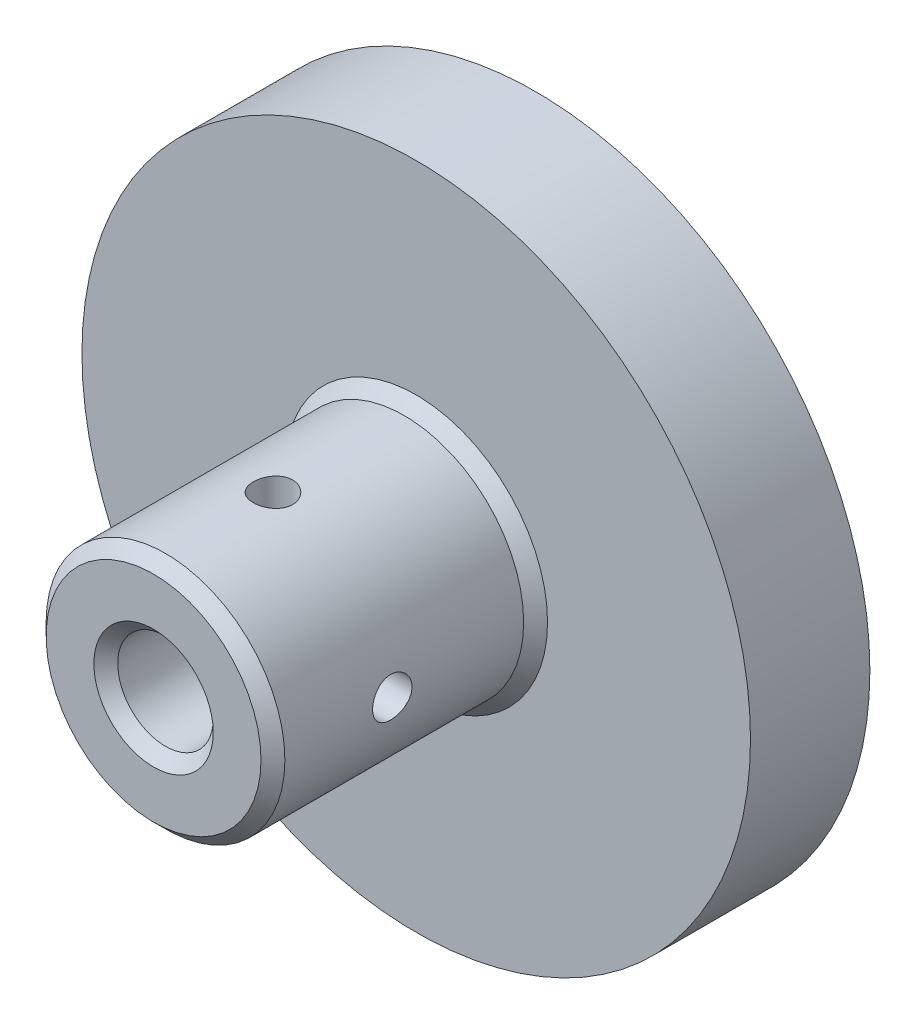
ISO-10303-21;
HEADER;
FILE_DESCRIPTION(('STEP AP214'),'2;1');
FILE_NAME('part.step','',(''),(''),'','','');
FILE_SCHEMA(('AUTOMOTIVE_DESIGN { 1 0 10303 214 1 1 1 1 }'));
ENDSEC;
DATA;
#1=APPLICATION_CONTEXT('core data for automotive mechanical design processes');
#2=APPLICATION_PROTOCOL_DEFINITION('international standard','automotive_design',2000,#1);
#3=PRODUCT_CONTEXT('',#1,'mechanical');
#4=PRODUCT('Part','Part','',(#3));
#5=PRODUCT_RELATED_PRODUCT_CATEGORY('part','',(#4));
#6=PRODUCT_DEFINITION_FORMATION('','',#4);
#7=PRODUCT_DEFINITION_CONTEXT('part definition',#1,'design');
#8=PRODUCT_DEFINITION('design','',#6,#7);
#9=PRODUCT_DEFINITION_SHAPE('','',#8);
#10=(LENGTH_UNIT() NAMED_UNIT(*) SI_UNIT(.MILLI.,.METRE.));
#11=(NAMED_UNIT(*) PLANE_ANGLE_UNIT() SI_UNIT($,.RADIAN.));
#12=(NAMED_UNIT(*) SI_UNIT($,.STERADIAN.) SOLID_ANGLE_UNIT());
#13=UNCERTAINTY_MEASURE_WITH_UNIT(LENGTH_MEASURE(1.E-05),#10,'distance_accuracy_value','');
#14=(GEOMETRIC_REPRESENTATION_CONTEXT(3) GLOBAL_UNCERTAINTY_ASSIGNED_CONTEXT((#13)) GLOBAL_UNIT_ASSIGNED_CONTEXT((#10,
#11,#12)) REPRESENTATION_CONTEXT('',''));
#15=CARTESIAN_POINT('',(0.,0.,0.));
#16=DIRECTION('',(0.,0.,1.));
#17=DIRECTION('',(1.,0.,0.));
#18=AXIS2_PLACEMENT_3D('',#15,#16,#17);
#19=CARTESIAN_POINT('',(0.,0.,10.));
#20=DIRECTION('',(0.,0.,-1.));
#21=DIRECTION('',(-1.,0.,0.));
#22=AXIS2_PLACEMENT_3D('',#19,#20,#21);
#23=CYLINDRICAL_SURFACE('',#22,28.);
#24=CARTESIAN_POINT('',(0.,0.,10.));
#25=DIRECTION('',(0.,0.,1.));
#26=DIRECTION('',(1.,0.,0.));
#27=AXIS2_PLACEMENT_3D('',#24,#25,#26);
#28=CIRCLE('',#27,28.);
#29=CARTESIAN_POINT('',(28.,0.,10.));
#30=VERTEX_POINT('',#29);
#31=EDGE_CURVE('E64',#30,#30,#28,.T.);
#32=ORIENTED_EDGE('',*,*,#31,.F.);
#33=EDGE_LOOP('',(#32));
#34=FACE_BOUND('',#33,.T.);
#35=CARTESIAN_POINT('',(0.,0.,0.));
#36=DIRECTION('',(0.,0.,1.));
#37=DIRECTION('',(1.,0.,0.));
#38=AXIS2_PLACEMENT_3D('',#35,#36,#37);
#39=CIRCLE('',#38,28.);
#40=CARTESIAN_POINT('',(28.,0.,0.));
#41=VERTEX_POINT('',#40);
#42=EDGE_CURVE('E65',#41,#41,#39,.T.);
#43=ORIENTED_EDGE('',*,*,#42,.T.);
#44=EDGE_LOOP('',(#43));
#45=FACE_BOUND('',#44,.T.);
#46=ADVANCED_FACE('F38',(#34,#45),#23,.T.);
#47=CARTESIAN_POINT('',(0.,0.,10.));
#48=DIRECTION('',(0.,0.,1.));
#49=DIRECTION('',(1.,0.,0.));
#50=AXIS2_PLACEMENT_3D('',#47,#48,#49);
#51=PLANE('',#50);
#52=CARTESIAN_POINT('',(0.,0.,10.));
#53=DIRECTION('',(0.,0.,1.));
#54=DIRECTION('',(1.,0.,0.));
#55=AXIS2_PLACEMENT_3D('',#52,#53,#54);
#56=CIRCLE('',#55,11.);
#57=CARTESIAN_POINT('',(11.,0.,10.));
#58=VERTEX_POINT('',#57);
#59=EDGE_CURVE('E11',#58,#58,#56,.F.);
#60=ORIENTED_EDGE('',*,*,#59,.T.);
#61=EDGE_LOOP('',(#60));
#62=FACE_BOUND('',#61,.T.);
#63=ORIENTED_EDGE('',*,*,#31,.T.);
#64=EDGE_LOOP('',(#63));
#65=FACE_BOUND('',#64,.T.);
#66=ADVANCED_FACE('F116',(#62,#65),#51,.T.);
#67=CARTESIAN_POINT('',(0.,0.,0.));
#68=DIRECTION('',(0.,0.,1.));
#69=DIRECTION('',(1.,0.,0.));
#70=AXIS2_PLACEMENT_3D('',#67,#68,#69);
#71=PLANE('',#70);
#72=CARTESIAN_POINT('',(0.,0.,0.));
#73=DIRECTION('',(0.,0.,1.));
#74=DIRECTION('',(1.,0.,0.));
#75=AXIS2_PLACEMENT_3D('',#72,#73,#74);
#76=CIRCLE('',#75,4.);
#77=CARTESIAN_POINT('',(4.,0.,0.));
#78=VERTEX_POINT('',#77);
#79=EDGE_CURVE('E68',#78,#78,#76,.T.);
#80=ORIENTED_EDGE('',*,*,#79,.T.);
#81=EDGE_LOOP('',(#80));
#82=FACE_BOUND('',#81,.T.);
#83=ORIENTED_EDGE('',*,*,#42,.F.);
#84=EDGE_LOOP('',(#83));
#85=FACE_BOUND('',#84,.T.);
#86=ADVANCED_FACE('F112',(#82,#85),#71,.F.);
#87=CARTESIAN_POINT('',(0.,0.,32.));
#88=DIRECTION('',(0.,0.,-1.));
#89=DIRECTION('',(-1.,0.,0.));
#90=AXIS2_PLACEMENT_3D('',#87,#88,#89);
#91=CYLINDRICAL_SURFACE('',#90,10.);
#92=CARTESIAN_POINT('',(10.,0.,20.35));
#93=CARTESIAN_POINT('',(9.99999843258099,-0.0920114531057513,20.3500037009853));
#94=CARTESIAN_POINT('',(9.99871684765511,-0.184073454347173,20.3577224586854));
#95=CARTESIAN_POINT('',(9.99372775496381,-0.36561632253533,20.3883812351379));
#96=CARTESIAN_POINT('',(9.99001800272159,-0.455094721351769,20.4113353369588));
#97=CARTESIAN_POINT('',(9.98058875631552,-0.628817487751617,20.4717536389359));
#98=CARTESIAN_POINT('',(9.974870893487,-0.713066038744489,20.5092060635603));
#99=CARTESIAN_POINT('',(9.96205444853338,-0.874072236504047,20.5975272541486));
#100=CARTESIAN_POINT('',(9.95495602786423,-0.950830757653335,20.648394451505));
#101=CARTESIAN_POINT('',(9.9400912001718,-1.09540879372213,20.7626087771329));
#102=CARTESIAN_POINT('',(9.93231968689365,-1.1631478788234,20.8260570636182));
#103=CARTESIAN_POINT('',(9.91702374723339,-1.28706950777736,20.9634147735932));
#104=CARTESIAN_POINT('',(9.90949933632427,-1.3432513290959,21.0373248506432));
#105=CARTESIAN_POINT('',(9.89550007731641,-1.44278500045255,21.1940593436766));
#106=CARTESIAN_POINT('',(9.88903182722124,-1.486057495709,21.2769347943439));
#107=CARTESIAN_POINT('',(9.87794796970923,-1.55803674048926,21.4489026252365));
#108=CARTESIAN_POINT('',(9.87333223970889,-1.58674445381558,21.5379945936492));
#109=CARTESIAN_POINT('',(9.86652679242373,-1.62852619503012,21.719014582001));
#110=CARTESIAN_POINT('',(9.86431555933323,-1.64173895927954,21.8109097556787));
#111=CARTESIAN_POINT('',(9.86250435770822,-1.6525858553069,21.9956373659234));
#112=CARTESIAN_POINT('',(9.86290420804218,-1.65022106770363,22.0884697370306));
#113=CARTESIAN_POINT('',(9.86625034802631,-1.63009303176281,22.2714472770567));
#114=CARTESIAN_POINT('',(9.86917088684506,-1.61248549472491,22.3616101140273));
#115=CARTESIAN_POINT('',(9.87718903199042,-1.56261607367814,22.5376840705334));
#116=CARTESIAN_POINT('',(9.88228671162732,-1.53035369619842,22.6235950467882));
#117=CARTESIAN_POINT('',(9.89411264039673,-1.45193210975576,22.7891935299244));
#118=CARTESIAN_POINT('',(9.90084846298693,-1.40570810605855,22.8688497892407));
#119=CARTESIAN_POINT('',(9.91518643931069,-1.30072141548382,23.0193343239077));
#120=CARTESIAN_POINT('',(9.92278866158315,-1.24195773629992,23.0901618999123));
#121=CARTESIAN_POINT('',(9.93811607123993,-1.11271072676608,23.2218799788826));
#122=CARTESIAN_POINT('',(9.94584163094155,-1.04209376928229,23.2826393946299));
#123=CARTESIAN_POINT('',(9.96045987838133,-0.891597059898627,23.3914660216062));
#124=CARTESIAN_POINT('',(9.9673525609492,-0.81171725050342,23.4395331540471));
#125=CARTESIAN_POINT('',(9.97953794169528,-0.644840083170818,23.5216221505343));
#126=CARTESIAN_POINT('',(9.98482933722618,-0.557837003156625,23.555632587638));
#127=CARTESIAN_POINT('',(9.99320544362233,-0.379246930002538,23.6085219127753));
#128=CARTESIAN_POINT('',(9.99629033536768,-0.28766031326089,23.6274020411448));
#129=CARTESIAN_POINT('',(9.99988156603306,-0.10363298381923,23.6493174611612));
#130=CARTESIAN_POINT('',(10.0004171933872,-0.0112142564119049,23.6525327361215));
#131=CARTESIAN_POINT('',(9.99892971175882,0.172841505554612,23.6435068013197));
#132=CARTESIAN_POINT('',(9.99690669920295,0.264478569441094,23.6312661740395));
#133=CARTESIAN_POINT('',(9.99054737820398,0.443814955541701,23.5918255972229));
#134=CARTESIAN_POINT('',(9.98622483070292,0.531534371938234,23.5647146056917));
#135=CARTESIAN_POINT('',(9.97574921956607,0.701182959294526,23.4963976074449));
#136=CARTESIAN_POINT('',(9.96959605484328,0.783111810188923,23.4551908223383));
#137=CARTESIAN_POINT('',(9.95606928426947,0.939636398877187,23.359438680501));
#138=CARTESIAN_POINT('',(9.94868555427359,1.01416235726441,23.3047807140829));
#139=CARTESIAN_POINT('',(9.93354765732488,1.15304841333202,23.1838328509312));
#140=CARTESIAN_POINT('',(9.92579346406183,1.2174077875821,23.1175421271457));
#141=CARTESIAN_POINT('',(9.91069407401677,1.33479962911466,22.9744038936717));
#142=CARTESIAN_POINT('',(9.90335382329476,1.38771058951938,22.8974561289012));
#143=CARTESIAN_POINT('',(9.89000528724129,1.47985547415611,22.7356589529326));
#144=CARTESIAN_POINT('',(9.88399696030452,1.51908982562642,22.6508097886681));
#145=CARTESIAN_POINT('',(9.87402953570154,1.58258535747081,22.4759604675969));
#146=CARTESIAN_POINT('',(9.87006212213644,1.60690737863644,22.3859829002034));
#147=CARTESIAN_POINT('',(9.86460473721113,1.64007952798871,22.2031486882195));
#148=CARTESIAN_POINT('',(9.86311455516769,1.64893097191814,22.1102922891519));
#149=CARTESIAN_POINT('',(9.86278931217107,1.65087457438791,21.9255493586982));
#150=CARTESIAN_POINT('',(9.86392203182987,1.6441579678695,21.8336648398079));
#151=CARTESIAN_POINT('',(9.86864441177183,1.61556925478543,21.6523522481362));
#152=CARTESIAN_POINT('',(9.87223406454433,1.59369719454883,21.5629241678464));
#153=CARTESIAN_POINT('',(9.88145370519206,1.53549112071354,21.3891347575646));
#154=CARTESIAN_POINT('',(9.8870814149876,1.49917324977363,21.3047678925491));
#155=CARTESIAN_POINT('',(9.89974533231771,1.41312606218932,21.1432937331397));
#156=CARTESIAN_POINT('',(9.90678160742253,1.36339610211419,21.0661867872723));
#157=CARTESIAN_POINT('',(9.92157214136343,1.25125259966704,20.9204545023623));
#158=CARTESIAN_POINT('',(9.92933379899766,1.18869826623125,20.8519382401805));
#159=CARTESIAN_POINT('',(9.94464125601211,1.05297867490408,20.7263094001233));
#160=CARTESIAN_POINT('',(9.95218700513286,0.97981097009266,20.6691994592198));
#161=CARTESIAN_POINT('',(9.96627143049841,0.824354696103038,20.5676525774265));
#162=CARTESIAN_POINT('',(9.97280295936929,0.742007852048179,20.523303852022));
#163=CARTESIAN_POINT('',(9.98405342047581,0.57095958692379,20.4491366471937));
#164=CARTESIAN_POINT('',(9.98877416450827,0.482264623543759,20.4193036358748));
#165=CARTESIAN_POINT('',(9.99483601455804,0.327682758240926,20.3815206584732));
#166=CARTESIAN_POINT('',(9.99676220083327,0.262733066711098,20.3697192511855));
#167=CARTESIAN_POINT('',(9.99934474465587,0.13186422762594,20.3539576610669));
#168=CARTESIAN_POINT('',(10.0000011233775,0.0659450962546684,20.3499973474842));
#169=CARTESIAN_POINT('',(10.,0.,20.35));
#170=B_SPLINE_CURVE_WITH_KNOTS('',3,(#92,#93,#94,#95,#96,#97,#98,#99,#100,#101,#102,#103,#104,
#105,#106,#107,#108,#109,#110,#111,#112,#113,#114,#115,#116,#117,#118,#119,#120,#121,#122,#123,
#124,#125,#126,#127,#128,#129,#130,#131,#132,#133,#134,#135,#136,#137,#138,#139,#140,#141,#142,
#143,#144,#145,#146,#147,#148,#149,#150,#151,#152,#153,#154,#155,#156,#157,#158,#159,#160,#161,
#162,#163,#164,#165,#166,#167,#168,#169),.UNSPECIFIED.,.T.,.F.,(4,2,2,2,2,2,2,2,2,2,2,2,2,2,2,2,
2,2,2,2,2,2,2,2,2,2,2,2,2,2,2,2,2,2,2,2,2,2,4),(0.,0.275793319008918,0.551841928312972,
0.8276667998706,1.10345943314171,1.38156673144316,1.65969141110741,1.93949209608633,
2.21927426326044,2.49653175525206,2.77377001402269,3.04820914252877,3.32265751287872,
3.59839967320042,3.87416366201706,4.1532757240192,4.43238951858747,4.71172976565332,
4.991047110928,5.26714751096616,5.54323750600189,5.81769359979004,6.09216485190803,
6.36901711215385,6.64588906369257,6.92556925596458,7.20524071063227,7.48376340648032,
7.76226241335696,8.03735855216245,8.31245385002402,8.58724259883659,8.86204453269316,
9.14004258759617,9.41810483731131,9.69804546871317,9.97770526783281,10.1753710978727,
10.3730336317698),.UNSPECIFIED.);
#171=CARTESIAN_POINT('',(10.,0.,20.35));
#172=VERTEX_POINT('',#171);
#173=EDGE_CURVE('E231',#172,#172,#170,.T.);
#174=ORIENTED_EDGE('',*,*,#173,.T.);
#175=EDGE_LOOP('',(#174));
#176=FACE_BOUND('',#175,.T.);
#177=CARTESIAN_POINT('',(0.,10.,23.65));
#178=CARTESIAN_POINT('',(-0.0920114531057509,9.99999843258099,23.6499962990147));
#179=CARTESIAN_POINT('',(-0.184073454347172,9.99871684765511,23.6422775413146));
#180=CARTESIAN_POINT('',(-0.365616322535328,9.99372775496381,23.6116187648621));
#181=CARTESIAN_POINT('',(-0.455094721351767,9.9900180027216,23.5886646630412));
#182=CARTESIAN_POINT('',(-0.628817487751612,9.98058875631552,23.5282463610641));
#183=CARTESIAN_POINT('',(-0.71306603874448,9.974870893487,23.4907939364397));
#184=CARTESIAN_POINT('',(-0.874072236504036,9.96205444853338,23.4024727458514));
#185=CARTESIAN_POINT('',(-0.950830757653324,9.95495602786423,23.351605548495));
#186=CARTESIAN_POINT('',(-1.09540879372212,9.9400912001718,23.2373912228671));
#187=CARTESIAN_POINT('',(-1.16314787882339,9.93231968689365,23.1739429363817));
#188=CARTESIAN_POINT('',(-1.28706950777735,9.9170237472334,23.0365852264068));
#189=CARTESIAN_POINT('',(-1.34325132909588,9.90949933632427,22.9626751493568));
#190=CARTESIAN_POINT('',(-1.44278500045253,9.89550007731641,22.8059406563233));
#191=CARTESIAN_POINT('',(-1.48605749570898,9.88903182722124,22.7230652056561));
#192=CARTESIAN_POINT('',(-1.55803674048924,9.87794796970923,22.5510973747635));
#193=CARTESIAN_POINT('',(-1.58674445381555,9.8733322397089,22.4620054063507));
#194=CARTESIAN_POINT('',(-1.62852619503009,9.86652679242373,22.280985417999));
#195=CARTESIAN_POINT('',(-1.64173895927951,9.86431555933323,22.1890902443212));
#196=CARTESIAN_POINT('',(-1.65258585530686,9.86250435770823,22.0043626340766));
#197=CARTESIAN_POINT('',(-1.65022106770359,9.86290420804218,21.9115302629694));
#198=CARTESIAN_POINT('',(-1.63009303176277,9.86625034802632,21.7285527229433));
#199=CARTESIAN_POINT('',(-1.61248549472487,9.86917088684506,21.6383898859726));
#200=CARTESIAN_POINT('',(-1.56261607367809,9.87718903199043,21.4623159294666));
#201=CARTESIAN_POINT('',(-1.53035369619838,9.88228671162733,21.3764049532117));
#202=CARTESIAN_POINT('',(-1.45193210975571,9.89411264039674,21.2108064700756));
#203=CARTESIAN_POINT('',(-1.4057081060585,9.90084846298694,21.1311502107593));
#204=CARTESIAN_POINT('',(-1.30072141548377,9.9151864393107,20.9806656760923));
#205=CARTESIAN_POINT('',(-1.24195773629987,9.92278866158316,20.9098381000877));
#206=CARTESIAN_POINT('',(-1.11271072676603,9.93811607123993,20.7781200211173));
#207=CARTESIAN_POINT('',(-1.04209376928222,9.94584163094155,20.7173606053701));
#208=CARTESIAN_POINT('',(-0.891597059898563,9.96045987838133,20.6085339783937));
#209=CARTESIAN_POINT('',(-0.811717250503355,9.9673525609492,20.5604668459529));
#210=CARTESIAN_POINT('',(-0.644840083170752,9.97953794169528,20.4783778494657));
#211=CARTESIAN_POINT('',(-0.557837003156558,9.98482933722619,20.444367412362));
#212=CARTESIAN_POINT('',(-0.37924693000247,9.99320544362233,20.3914780872247));
#213=CARTESIAN_POINT('',(-0.287660313260821,9.99629033536768,20.3725979588552));
#214=CARTESIAN_POINT('',(-0.103632983819161,9.99988156603306,20.3506825388388));
#215=CARTESIAN_POINT('',(-0.0112142564118364,10.0004171933872,20.3474672638785));
#216=CARTESIAN_POINT('',(0.17284150555468,9.99892971175882,20.3564931986803));
#217=CARTESIAN_POINT('',(0.264478569441162,9.99690669920295,20.3687338259605));
#218=CARTESIAN_POINT('',(0.443814955541767,9.99054737820398,20.4081744027771));
#219=CARTESIAN_POINT('',(0.531534371938299,9.98622483070291,20.4352853943084));
#220=CARTESIAN_POINT('',(0.70118295929459,9.97574921956607,20.5036023925551));
#221=CARTESIAN_POINT('',(0.783111810188987,9.96959605484327,20.5448091776617));
#222=CARTESIAN_POINT('',(0.939636398877249,9.95606928426946,20.640561319499));
#223=CARTESIAN_POINT('',(1.01416235726447,9.94868555427359,20.6952192859171));
#224=CARTESIAN_POINT('',(1.15304841333208,9.93354765732487,20.8161671490688));
#225=CARTESIAN_POINT('',(1.21740778758216,9.92579346406183,20.8824578728543));
#226=CARTESIAN_POINT('',(1.33479962911471,9.91069407401676,21.0255961063283));
#227=CARTESIAN_POINT('',(1.38771058951943,9.90335382329476,21.1025438710988));
#228=CARTESIAN_POINT('',(1.47985547415616,9.89000528724129,21.2643410470675));
#229=CARTESIAN_POINT('',(1.51908982562647,9.88399696030451,21.3491902113319));
#230=CARTESIAN_POINT('',(1.58258535747086,9.87402953570153,21.5240395324031));
#231=CARTESIAN_POINT('',(1.60690737863648,9.87006212213643,21.6140170997967));
#232=CARTESIAN_POINT('',(1.64007952798875,9.86460473721113,21.7968513117806));
#233=CARTESIAN_POINT('',(1.64893097191818,9.86311455516768,21.8897077108482));
#234=CARTESIAN_POINT('',(1.65087457438795,9.86278931217107,22.0744506413018));
#235=CARTESIAN_POINT('',(1.64415796786953,9.86392203182987,22.1663351601921));
#236=CARTESIAN_POINT('',(1.61556925478546,9.86864441177183,22.3476477518639));
#237=CARTESIAN_POINT('',(1.59369719454886,9.87223406454433,22.4370758321536));
#238=CARTESIAN_POINT('',(1.53549112071356,9.88145370519205,22.6108652424354));
#239=CARTESIAN_POINT('',(1.49917324977365,9.88708141498759,22.695232107451));
#240=CARTESIAN_POINT('',(1.41312606218934,9.89974533231771,22.8567062668603));
#241=CARTESIAN_POINT('',(1.36339610211421,9.90678160742252,22.9338132127277));
#242=CARTESIAN_POINT('',(1.25125259966706,9.92157214136343,23.0795454976377));
#243=CARTESIAN_POINT('',(1.18869826623126,9.92933379899765,23.1480617598196));
#244=CARTESIAN_POINT('',(1.05297867490409,9.94464125601211,23.2736905998767));
#245=CARTESIAN_POINT('',(0.979810970092669,9.95218700513286,23.3308005407802));
#246=CARTESIAN_POINT('',(0.824354696103044,9.96627143049842,23.4323474225735));
#247=CARTESIAN_POINT('',(0.742007852048184,9.97280295936929,23.476696147978));
#248=CARTESIAN_POINT('',(0.570959586923792,9.98405342047581,23.5508633528063));
#249=CARTESIAN_POINT('',(0.482264623543761,9.98877416450827,23.5806963641252));
#250=CARTESIAN_POINT('',(0.327682758240928,9.99483601455804,23.6184793415268));
#251=CARTESIAN_POINT('',(0.2627330667111,9.99676220083327,23.6302807488145));
#252=CARTESIAN_POINT('',(0.131864227625941,9.99934474465587,23.6460423389331));
#253=CARTESIAN_POINT('',(0.065945096254669,10.0000011233775,23.6500026525158));
#254=CARTESIAN_POINT('',(0.,10.,23.65));
#255=B_SPLINE_CURVE_WITH_KNOTS('',3,(#177,#178,#179,#180,#181,#182,#183,#184,#185,#186,#187,
#188,#189,#190,#191,#192,#193,#194,#195,#196,#197,#198,#199,#200,#201,#202,#203,#204,#205,#206,
#207,#208,#209,#210,#211,#212,#213,#214,#215,#216,#217,#218,#219,#220,#221,#222,#223,#224,#225,
#226,#227,#228,#229,#230,#231,#232,#233,#234,#235,#236,#237,#238,#239,#240,#241,#242,#243,#244,
#245,#246,#247,#248,#249,#250,#251,#252,#253,#254),.UNSPECIFIED.,.T.,.F.,(4,2,2,2,2,2,2,2,2,2,2,
2,2,2,2,2,2,2,2,2,2,2,2,2,2,2,2,2,2,2,2,2,2,2,2,2,2,2,4),(0.,0.275793319008917,
0.551841928312971,0.827666799870593,1.1034594331417,1.38156673144315,1.65969141110741,
1.93949209608633,2.21927426326044,2.49653175525206,2.77377001402269,3.04820914252876,
3.32265751287871,3.59839967320041,3.87416366201706,4.1532757240192,4.43238951858747,
4.71172976565331,4.991047110928,5.26714751096616,5.54323750600189,5.81769359979003,
6.09216485190802,6.36901711215385,6.64588906369257,6.92556925596458,7.20524071063227,
7.48376340648031,7.76226241335695,8.03735855216244,8.31245385002402,8.58724259883658,
8.86204453269315,9.14004258759616,9.4181048373113,9.69804546871317,9.9777052678328,
10.1753710978727,10.3730336317698),.UNSPECIFIED.);
#256=CARTESIAN_POINT('',(0.,10.,23.65));
#257=VERTEX_POINT('',#256);
#258=EDGE_CURVE('E73',#257,#257,#255,.T.);
#259=ORIENTED_EDGE('',*,*,#258,.T.);
#260=EDGE_LOOP('',(#259));
#261=FACE_BOUND('',#260,.T.);
#262=CARTESIAN_POINT('',(0.,0.,11.));
#263=DIRECTION('',(0.,0.,1.));
#264=DIRECTION('',(1.,0.,0.));
#265=AXIS2_PLACEMENT_3D('',#262,#263,#264);
#266=CIRCLE('',#265,10.);
#267=CARTESIAN_POINT('',(10.,0.,11.));
#268=VERTEX_POINT('',#267);
#269=EDGE_CURVE('E45',#268,#268,#266,.T.);
#270=ORIENTED_EDGE('',*,*,#269,.T.);
#271=EDGE_LOOP('',(#270));
#272=FACE_BOUND('',#271,.T.);
#273=CARTESIAN_POINT('',(0.,0.,31.));
#274=DIRECTION('',(0.,0.,1.));
#275=DIRECTION('',(1.,0.,0.));
#276=AXIS2_PLACEMENT_3D('',#273,#274,#275);
#277=CIRCLE('',#276,10.);
#278=CARTESIAN_POINT('',(10.,0.,31.));
#279=VERTEX_POINT('',#278);
#280=EDGE_CURVE('E49',#279,#279,#277,.F.);
#281=ORIENTED_EDGE('',*,*,#280,.T.);
#282=EDGE_LOOP('',(#281));
#283=FACE_BOUND('',#282,.T.);
#284=ADVANCED_FACE('F87',(#176,#261,#272,#283),#91,.T.);
#285=CARTESIAN_POINT('',(0.,0.,32.));
#286=DIRECTION('',(0.,0.,1.));
#287=DIRECTION('',(1.,0.,0.));
#288=AXIS2_PLACEMENT_3D('',#285,#286,#287);
#289=PLANE('',#288);
#290=CARTESIAN_POINT('',(0.,0.,32.));
#291=DIRECTION('',(0.,0.,1.));
#292=DIRECTION('',(1.,0.,0.));
#293=AXIS2_PLACEMENT_3D('',#290,#291,#292);
#294=CIRCLE('',#293,5.00000000000001);
#295=CARTESIAN_POINT('',(5.00000000000001,0.,32.));
#296=VERTEX_POINT('',#295);
#297=EDGE_CURVE('E53',#296,#296,#294,.F.);
#298=ORIENTED_EDGE('',*,*,#297,.T.);
#299=EDGE_LOOP('',(#298));
#300=FACE_BOUND('',#299,.T.);
#301=CARTESIAN_POINT('',(0.,0.,32.));
#302=DIRECTION('',(0.,0.,1.));
#303=DIRECTION('',(1.,0.,0.));
#304=AXIS2_PLACEMENT_3D('',#301,#302,#303);
#305=CIRCLE('',#304,9.);
#306=CARTESIAN_POINT('',(9.,0.,32.));
#307=VERTEX_POINT('',#306);
#308=EDGE_CURVE('E58',#307,#307,#305,.T.);
#309=ORIENTED_EDGE('',*,*,#308,.T.);
#310=EDGE_LOOP('',(#309));
#311=FACE_BOUND('',#310,.T.);
#312=ADVANCED_FACE('F105',(#300,#311),#289,.T.);
#313=CARTESIAN_POINT('',(0.,0.,0.));
#314=DIRECTION('',(0.,0.,1.));
#315=DIRECTION('',(1.,0.,0.));
#316=AXIS2_PLACEMENT_3D('',#313,#314,#315);
#317=CYLINDRICAL_SURFACE('',#316,4.);
#318=CARTESIAN_POINT('',(4.,0.,20.35));
#319=CARTESIAN_POINT('',(3.99999309817074,0.0884596783632789,20.3500092172066));
#320=CARTESIAN_POINT('',(3.99703145792172,0.177062252057582,20.3571560143433));
#321=CARTESIAN_POINT('',(3.9854711320255,0.351759669836408,20.3854911419369));
#322=CARTESIAN_POINT('',(3.97685757767607,0.437847271996958,20.4067165110243));
#323=CARTESIAN_POINT('',(3.95491965529936,0.604702496902737,20.4622948122019));
#324=CARTESIAN_POINT('',(3.94161112398211,0.685486934491192,20.4966036433535));
#325=CARTESIAN_POINT('',(3.91158286286531,0.840076633223481,20.5771947578495));
#326=CARTESIAN_POINT('',(3.89486420463244,0.913884076117558,20.6234732811702));
#327=CARTESIAN_POINT('',(3.85876900012149,1.05618769598524,20.7291067546441));
#328=CARTESIAN_POINT('',(3.83930654387258,1.12429373957475,20.788957670249));
#329=CARTESIAN_POINT('',(3.80029483347099,1.24983574384756,20.918988839659));
#330=CARTESIAN_POINT('',(3.78074553976623,1.30726618926956,20.9891743992118));
#331=CARTESIAN_POINT('',(3.74272551686067,1.41254826809048,21.1419682488717));
#332=CARTESIAN_POINT('',(3.72435159658093,1.45980781790559,21.2250111153066));
#333=CARTESIAN_POINT('',(3.69212136090387,1.53951358199404,21.3987363092902));
#334=CARTESIAN_POINT('',(3.67826276509116,1.57196727712788,21.4894147513631));
#335=CARTESIAN_POINT('',(3.65756021871624,1.61953738222489,21.6713479970019));
#336=CARTESIAN_POINT('',(3.65041449103238,1.6354037141715,21.7623710721431));
#337=CARTESIAN_POINT('',(3.64307714795705,1.65168918120799,21.9460465073653));
#338=CARTESIAN_POINT('',(3.6428818057274,1.65211659473996,22.0386979676293));
#339=CARTESIAN_POINT('',(3.64921138579607,1.63807780779826,22.2155988866188));
#340=CARTESIAN_POINT('',(3.65523439741042,1.62472398487454,22.2999581587492));
#341=CARTESIAN_POINT('',(3.67247532251839,1.58536484231193,22.4651102843812));
#342=CARTESIAN_POINT('',(3.68369420783861,1.5593571558718,22.5459024676033));
#343=CARTESIAN_POINT('',(3.71031458481433,1.49492412942483,22.7036451087586));
#344=CARTESIAN_POINT('',(3.72579923184193,1.45624866973011,22.7804787378084));
#345=CARTESIAN_POINT('',(3.75918616236909,1.36775445443618,22.9268602324601));
#346=CARTESIAN_POINT('',(3.77708938726887,1.31793135478153,22.9964052422492));
#347=CARTESIAN_POINT('',(3.81509742396097,1.20371911924862,23.1322864077878));
#348=CARTESIAN_POINT('',(3.83526188253692,1.13846630094382,23.1978819577033));
#349=CARTESIAN_POINT('',(3.87426910607355,0.997682554866143,23.3174446744414));
#350=CARTESIAN_POINT('',(3.89311157289531,0.922149319847359,23.3714092238609));
#351=CARTESIAN_POINT('',(3.92787932271739,0.760736369737248,23.4672347735851));
#352=CARTESIAN_POINT('',(3.94373050716792,0.67466409407216,23.5088002831942));
#353=CARTESIAN_POINT('',(3.97016319816606,0.495928253552899,23.5766030241089));
#354=CARTESIAN_POINT('',(3.98074755693755,0.403268287372308,23.6028485532112));
#355=CARTESIAN_POINT('',(3.99492450637935,0.220181304317597,23.6377295036782));
#356=CARTESIAN_POINT('',(3.99891121146316,0.129974172308146,23.6473591779359));
#357=CARTESIAN_POINT('',(4.00069746426785,-0.0508474401522959,23.6516920437633));
#358=CARTESIAN_POINT('',(3.99849874371343,-0.141461799500638,23.6463994131082));
#359=CARTESIAN_POINT('',(3.98841747083846,-0.315907755487618,23.621754731757));
#360=CARTESIAN_POINT('',(3.98081531688809,-0.399855317526753,23.6030959266599));
#361=CARTESIAN_POINT('',(3.9609888780309,-0.563340473329641,23.5532079036629));
#362=CARTESIAN_POINT('',(3.94876400644331,-0.642877505872212,23.5219770901852));
#363=CARTESIAN_POINT('',(3.92039728883463,-0.798061975964539,23.4468106200191));
#364=CARTESIAN_POINT('',(3.90414585630854,-0.87351265666057,23.4025114382438));
#365=CARTESIAN_POINT('',(3.86946768187547,-1.01617847320913,23.3028660657421));
#366=CARTESIAN_POINT('',(3.85104004134397,-1.08339018342116,23.2475153049101));
#367=CARTESIAN_POINT('',(3.81240295844538,-1.21261994292747,23.122795695188));
#368=CARTESIAN_POINT('',(3.7921591649383,-1.27394364561828,23.0527161759607));
#369=CARTESIAN_POINT('',(3.75333928940829,-1.38414835482511,22.9029287093914));
#370=CARTESIAN_POINT('',(3.73476355904107,-1.43302674162732,22.8232187400574));
#371=CARTESIAN_POINT('',(3.70128700339841,-1.51742282291392,22.6549046294666));
#372=CARTESIAN_POINT('',(3.68643724424494,-1.55275802936539,22.5661980839919));
#373=CARTESIAN_POINT('',(3.66281640168179,-1.60769618165397,22.3832908340217));
#374=CARTESIAN_POINT('',(3.65404044124934,-1.62731175174757,22.2890946035818));
#375=CARTESIAN_POINT('',(3.64429559365238,-1.64901123940271,22.1055697268419));
#376=CARTESIAN_POINT('',(3.64278573581522,-1.65231049364128,22.016412780542));
#377=CARTESIAN_POINT('',(3.64631178238902,-1.6445148535657,21.8388715292408));
#378=CARTESIAN_POINT('',(3.65134672892695,-1.63342206561732,21.7504871130806));
#379=CARTESIAN_POINT('',(3.66690490418699,-1.59817118006574,21.5810669287423));
#380=CARTESIAN_POINT('',(3.6771726120025,-1.57461958437456,21.4998792885779));
#381=CARTESIAN_POINT('',(3.70184411206583,-1.51570599472929,21.3425854775259));
#382=CARTESIAN_POINT('',(3.7162490615217,-1.48034069596894,21.2664807357024));
#383=CARTESIAN_POINT('',(3.7486340889516,-1.39638062253792,21.1165779617586));
#384=CARTESIAN_POINT('',(3.76677577854002,-1.34712443599272,21.0431859289786));
#385=CARTESIAN_POINT('',(3.80412864636709,-1.23771718137823,20.9053283127357));
#386=CARTESIAN_POINT('',(3.82334018195056,-1.17756245772963,20.8408657372256));
#387=CARTESIAN_POINT('',(3.86230172013188,-1.04300738755744,20.7180058612963));
#388=CARTESIAN_POINT('',(3.88199359359226,-0.967900110730178,20.6603607763945));
#389=CARTESIAN_POINT('',(3.91832426905579,-0.808343463182033,20.5584598404613));
#390=CARTESIAN_POINT('',(3.9349616732268,-0.723889843442849,20.5142101136341));
#391=CARTESIAN_POINT('',(3.96305691394126,-0.549414760109626,20.4413362601652));
#392=CARTESIAN_POINT('',(3.97459855421812,-0.459513381649423,20.4124575746414));
#393=CARTESIAN_POINT('',(3.99154438775475,-0.27571922921324,20.3704889152149));
#394=CARTESIAN_POINT('',(3.99696786149576,-0.181839966818027,20.3573493337546));
#395=CARTESIAN_POINT('',(3.99968194626838,-0.0584442952271949,20.35077322967));
#396=CARTESIAN_POINT('',(4.00000228058838,-0.0292299486703373,20.3499969543358));
#397=CARTESIAN_POINT('',(4.,0.,20.35));
#398=B_SPLINE_CURVE_WITH_KNOTS('',3,(#318,#319,#320,#321,#322,#323,#324,#325,#326,#327,#328,
#329,#330,#331,#332,#333,#334,#335,#336,#337,#338,#339,#340,#341,#342,#343,#344,#345,#346,#347,
#348,#349,#350,#351,#352,#353,#354,#355,#356,#357,#358,#359,#360,#361,#362,#363,#364,#365,#366,
#367,#368,#369,#370,#371,#372,#373,#374,#375,#376,#377,#378,#379,#380,#381,#382,#383,#384,#385,
#386,#387,#388,#389,#390,#391,#392,#393,#394,#395,#396,#397),.UNSPECIFIED.,.T.,.F.,(4,2,2,2,2,2,
2,2,2,2,2,2,2,2,2,2,2,2,2,2,2,2,2,2,2,2,2,2,2,2,2,2,2,2,2,2,2,2,2,4),(0.,0.26529709877062,
0.531294937906659,0.79640398149888,1.06142984766523,1.33841878994456,1.61555043582129,
1.90598404924538,2.19627075414924,2.4727764853942,2.74913395037958,3.00480633611682,
3.26052656166859,3.5216353930134,3.78284615202014,4.06565185095455,4.34852112528508,
4.63767392136375,4.92666995726766,5.19768149557684,5.46861716672803,5.72643264660552,
5.98428085748382,6.25011488704504,6.51605907418431,6.80064580250401,7.08529238632157,
7.3736498522578,7.66177550895674,7.92807823226722,8.19434198489782,8.44869772098557,
8.70312467109942,8.97267479984707,9.24231550885211,9.5310408581654,9.81989801073176,
10.1038095613048,10.3868238858898,10.4744866574818),.UNSPECIFIED.);
#399=CARTESIAN_POINT('',(4.,0.,20.35));
#400=VERTEX_POINT('',#399);
#401=EDGE_CURVE('E227',#400,#400,#398,.T.);
#402=ORIENTED_EDGE('',*,*,#401,.T.);
#403=EDGE_LOOP('',(#402));
#404=FACE_BOUND('',#403,.T.);
#405=CARTESIAN_POINT('',(0.,4.,23.65));
#406=CARTESIAN_POINT('',(0.0884596783632783,3.99999309817074,23.6499907827934));
#407=CARTESIAN_POINT('',(0.177062252057581,3.99703145792172,23.6428439856567));
#408=CARTESIAN_POINT('',(0.351759669836407,3.9854711320255,23.6145088580631));
#409=CARTESIAN_POINT('',(0.437847271996959,3.97685757767606,23.5932834889757));
#410=CARTESIAN_POINT('',(0.604702496902738,3.95491965529936,23.5377051877981));
#411=CARTESIAN_POINT('',(0.685486934491192,3.94161112398211,23.5033963566465));
#412=CARTESIAN_POINT('',(0.840076633223482,3.91158286286531,23.4228052421506));
#413=CARTESIAN_POINT('',(0.913884076117562,3.89486420463244,23.3765267188298));
#414=CARTESIAN_POINT('',(1.05618769598525,3.85876900012149,23.2708932453559));
#415=CARTESIAN_POINT('',(1.12429373957476,3.83930654387258,23.211042329751));
#416=CARTESIAN_POINT('',(1.24983574384756,3.80029483347099,23.081011160341));
#417=CARTESIAN_POINT('',(1.30726618926956,3.78074553976622,23.0108256007882));
#418=CARTESIAN_POINT('',(1.41254826809049,3.74272551686067,22.8580317511283));
#419=CARTESIAN_POINT('',(1.45980781790561,3.72435159658093,22.7749888846935));
#420=CARTESIAN_POINT('',(1.53951358199406,3.69212136090386,22.6012636907098));
#421=CARTESIAN_POINT('',(1.5719672771279,3.67826276509115,22.510585248637));
#422=CARTESIAN_POINT('',(1.61953738222491,3.65756021871623,22.3286520029982));
#423=CARTESIAN_POINT('',(1.63540371417153,3.65041449103237,22.2376289278569));
#424=CARTESIAN_POINT('',(1.65168918120802,3.64307714795703,22.0539534926347));
#425=CARTESIAN_POINT('',(1.65211659474,3.64288180572738,21.9613020323707));
#426=CARTESIAN_POINT('',(1.6380778077983,3.64921138579605,21.7844011133813));
#427=CARTESIAN_POINT('',(1.62472398487458,3.6552343974104,21.7000418412508));
#428=CARTESIAN_POINT('',(1.58536484231197,3.67247532251837,21.5348897156188));
#429=CARTESIAN_POINT('',(1.55935715587184,3.68369420783859,21.4540975323967));
#430=CARTESIAN_POINT('',(1.49492412942488,3.71031458481431,21.2963548912414));
#431=CARTESIAN_POINT('',(1.45624866973016,3.72579923184191,21.2195212621917));
#432=CARTESIAN_POINT('',(1.36775445443624,3.75918616236907,21.07313976754));
#433=CARTESIAN_POINT('',(1.31793135478159,3.77708938726885,21.0035947577509));
#434=CARTESIAN_POINT('',(1.20371911924869,3.81509742396095,20.8677135922122));
#435=CARTESIAN_POINT('',(1.13846630094388,3.8352618825369,20.8021180422967));
#436=CARTESIAN_POINT('',(0.997682554866212,3.87426910607353,20.6825553255586));
#437=CARTESIAN_POINT('',(0.922149319847431,3.8931115728953,20.6285907761392));
#438=CARTESIAN_POINT('',(0.760736369737323,3.92787932271737,20.532765226415));
#439=CARTESIAN_POINT('',(0.674664094072236,3.94373050716791,20.4911997168058));
#440=CARTESIAN_POINT('',(0.495928253552977,3.97016319816605,20.4233969758911));
#441=CARTESIAN_POINT('',(0.403268287372385,3.98074755693754,20.3971514467888));
#442=CARTESIAN_POINT('',(0.220181304317674,3.99492450637935,20.3622704963218));
#443=CARTESIAN_POINT('',(0.129974172308223,3.99891121146315,20.3526408220641));
#444=CARTESIAN_POINT('',(-0.0508474401522209,4.00069746426785,20.3483079562367));
#445=CARTESIAN_POINT('',(-0.141461799500565,3.99849874371343,20.3536005868918));
#446=CARTESIAN_POINT('',(-0.315907755487546,3.98841747083847,20.378245268243));
#447=CARTESIAN_POINT('',(-0.399855317526683,3.9808153168881,20.3969040733401));
#448=CARTESIAN_POINT('',(-0.563340473329572,3.96098887803091,20.4467920963371));
#449=CARTESIAN_POINT('',(-0.642877505872143,3.94876400644332,20.4780229098148));
#450=CARTESIAN_POINT('',(-0.798061975964472,3.92039728883464,20.5531893799809));
#451=CARTESIAN_POINT('',(-0.873512656660503,3.90414585630856,20.5974885617562));
#452=CARTESIAN_POINT('',(-1.01617847320907,3.86946768187548,20.6971339342579));
#453=CARTESIAN_POINT('',(-1.0833901834211,3.85104004134398,20.7524846950898));
#454=CARTESIAN_POINT('',(-1.21261994292741,3.8124029584454,20.877204304812));
#455=CARTESIAN_POINT('',(-1.27394364561821,3.79215916493832,20.9472838240393));
#456=CARTESIAN_POINT('',(-1.38414835482505,3.75333928940831,21.0970712906085));
#457=CARTESIAN_POINT('',(-1.43302674162726,3.73476355904109,21.1767812599426));
#458=CARTESIAN_POINT('',(-1.51742282291387,3.70128700339843,21.3450953705333));
#459=CARTESIAN_POINT('',(-1.55275802936534,3.68643724424496,21.4338019160081));
#460=CARTESIAN_POINT('',(-1.60769618165393,3.66281640168181,21.6167091659782));
#461=CARTESIAN_POINT('',(-1.62731175174752,3.65404044124936,21.7109053964182));
#462=CARTESIAN_POINT('',(-1.64901123940267,3.64429559365239,21.8944302731581));
#463=CARTESIAN_POINT('',(-1.65231049364124,3.64278573581524,21.9835872194579));
#464=CARTESIAN_POINT('',(-1.64451485356567,3.64631178238903,22.1611284707592));
#465=CARTESIAN_POINT('',(-1.63342206561729,3.65134672892697,22.2495128869194));
#466=CARTESIAN_POINT('',(-1.59817118006571,3.666904904187,22.4189330712577));
#467=CARTESIAN_POINT('',(-1.57461958437453,3.67717261200251,22.5001207114221));
#468=CARTESIAN_POINT('',(-1.51570599472927,3.70184411206584,22.6574145224741));
#469=CARTESIAN_POINT('',(-1.48034069596892,3.71624906152171,22.7335192642976));
#470=CARTESIAN_POINT('',(-1.3963806225379,3.7486340889516,22.8834220382414));
#471=CARTESIAN_POINT('',(-1.34712443599271,3.76677577854003,22.9568140710214));
#472=CARTESIAN_POINT('',(-1.23771718137822,3.80412864636709,23.0946716872643));
#473=CARTESIAN_POINT('',(-1.17756245772962,3.82334018195057,23.1591342627744));
#474=CARTESIAN_POINT('',(-1.04300738755743,3.86230172013188,23.2819941387037));
#475=CARTESIAN_POINT('',(-0.967900110730173,3.88199359359226,23.3396392236055));
#476=CARTESIAN_POINT('',(-0.808343463182031,3.91832426905579,23.4415401595387));
#477=CARTESIAN_POINT('',(-0.723889843442847,3.9349616732268,23.4857898863659));
#478=CARTESIAN_POINT('',(-0.549414760109625,3.96305691394126,23.5586637398347));
#479=CARTESIAN_POINT('',(-0.459513381649424,3.97459855421812,23.5875424253585));
#480=CARTESIAN_POINT('',(-0.275719229213242,3.99154438775475,23.6295110847851));
#481=CARTESIAN_POINT('',(-0.18183996681803,3.99696786149576,23.6426506662454));
#482=CARTESIAN_POINT('',(-0.0584442952271974,3.99968194626838,23.64922677033));
#483=CARTESIAN_POINT('',(-0.0292299486703385,4.00000228058838,23.6500030456642));
#484=CARTESIAN_POINT('',(0.,4.,23.65));
#485=B_SPLINE_CURVE_WITH_KNOTS('',3,(#405,#406,#407,#408,#409,#410,#411,#412,#413,#414,#415,
#416,#417,#418,#419,#420,#421,#422,#423,#424,#425,#426,#427,#428,#429,#430,#431,#432,#433,#434,
#435,#436,#437,#438,#439,#440,#441,#442,#443,#444,#445,#446,#447,#448,#449,#450,#451,#452,#453,
#454,#455,#456,#457,#458,#459,#460,#461,#462,#463,#464,#465,#466,#467,#468,#469,#470,#471,#472,
#473,#474,#475,#476,#477,#478,#479,#480,#481,#482,#483,#484),.UNSPECIFIED.,.T.,.F.,(4,2,2,2,2,2,
2,2,2,2,2,2,2,2,2,2,2,2,2,2,2,2,2,2,2,2,2,2,2,2,2,2,2,2,2,2,2,2,2,4),(0.,0.265297098770618,
0.531294937906658,0.796403981498876,1.06142984766522,1.33841878994456,1.61555043582129,
1.90598404924537,2.19627075414924,2.4727764853942,2.74913395037959,3.00480633611682,
3.2605265616686,3.5216353930134,3.78284615202013,4.06565185095454,4.34852112528507,
4.63767392136374,4.92666995726766,5.19768149557684,5.46861716672803,5.72643264660552,
5.98428085748382,6.25011488704504,6.5160590741843,6.800645802504,7.08529238632156,
7.37364985225779,7.66177550895673,7.92807823226721,8.19434198489782,8.44869772098557,
8.70312467109942,8.97267479984707,9.2423155088521,9.53104085816539,9.81989801073176,
10.1038095613048,10.3868238858898,10.4744866574817),.UNSPECIFIED.);
#486=CARTESIAN_POINT('',(0.,4.,23.65));
#487=VERTEX_POINT('',#486);
#488=EDGE_CURVE('E81',#487,#487,#485,.T.);
#489=ORIENTED_EDGE('',*,*,#488,.T.);
#490=EDGE_LOOP('',(#489));
#491=FACE_BOUND('',#490,.T.);
#492=CARTESIAN_POINT('',(0.,0.,31.));
#493=DIRECTION('',(0.,0.,1.));
#494=DIRECTION('',(1.,0.,0.));
#495=AXIS2_PLACEMENT_3D('',#492,#493,#494);
#496=CIRCLE('',#495,4.);
#497=CARTESIAN_POINT('',(4.,0.,31.));
#498=VERTEX_POINT('',#497);
#499=EDGE_CURVE('E61',#498,#498,#496,.T.);
#500=ORIENTED_EDGE('',*,*,#499,.T.);
#501=EDGE_LOOP('',(#500));
#502=FACE_BOUND('',#501,.T.);
#503=ORIENTED_EDGE('',*,*,#79,.F.);
#504=EDGE_LOOP('',(#503));
#505=FACE_BOUND('',#504,.T.);
#506=ADVANCED_FACE('F102',(#404,#491,#502,#505),#317,.F.);
#507=CARTESIAN_POINT('',(0.,0.,31.));
#508=DIRECTION('',(0.,0.,1.));
#509=DIRECTION('',(1.,0.,0.));
#510=AXIS2_PLACEMENT_3D('',#507,#508,#509);
#511=CONICAL_SURFACE('',#510,4.,0.785398163397452);
#512=ORIENTED_EDGE('',*,*,#297,.F.);
#513=EDGE_LOOP('',(#512));
#514=FACE_BOUND('',#513,.T.);
#515=ORIENTED_EDGE('',*,*,#499,.F.);
#516=EDGE_LOOP('',(#515));
#517=FACE_BOUND('',#516,.T.);
#518=ADVANCED_FACE('F104',(#514,#517),#511,.F.);
#519=CARTESIAN_POINT('',(0.,0.,11.));
#520=DIRECTION('',(0.,0.,-1.));
#521=DIRECTION('',(-1.,0.,0.));
#522=AXIS2_PLACEMENT_3D('',#519,#520,#521);
#523=CONICAL_SURFACE('',#522,10.,0.785398163397446);
#524=ORIENTED_EDGE('',*,*,#59,.F.);
#525=EDGE_LOOP('',(#524));
#526=FACE_BOUND('',#525,.T.);
#527=ORIENTED_EDGE('',*,*,#269,.F.);
#528=EDGE_LOOP('',(#527));
#529=FACE_BOUND('',#528,.T.);
#530=ADVANCED_FACE('F127',(#526,#529),#523,.T.);
#531=CARTESIAN_POINT('',(0.,0.,32.));
#532=DIRECTION('',(0.,0.,-1.));
#533=DIRECTION('',(-1.,0.,0.));
#534=AXIS2_PLACEMENT_3D('',#531,#532,#533);
#535=CONICAL_SURFACE('',#534,9.,0.785398163397447);
#536=ORIENTED_EDGE('',*,*,#280,.F.);
#537=EDGE_LOOP('',(#536));
#538=FACE_BOUND('',#537,.T.);
#539=ORIENTED_EDGE('',*,*,#308,.F.);
#540=EDGE_LOOP('',(#539));
#541=FACE_BOUND('',#540,.T.);
#542=ADVANCED_FACE('F40',(#538,#541),#535,.T.);
#543=CARTESIAN_POINT('',(0.,10.,22.));
#544=DIRECTION('',(0.,1.,0.));
#545=DIRECTION('',(0.,0.,1.));
#546=AXIS2_PLACEMENT_3D('',#543,#544,#545);
#547=CYLINDRICAL_SURFACE('',#546,1.64999999999999);
#548=ORIENTED_EDGE('',*,*,#488,.F.);
#549=EDGE_LOOP('',(#548));
#550=FACE_BOUND('',#549,.T.);
#551=ORIENTED_EDGE('',*,*,#258,.F.);
#552=EDGE_LOOP('',(#551));
#553=FACE_BOUND('',#552,.T.);
#554=ADVANCED_FACE('F91',(#550,#553),#547,.F.);
#555=CARTESIAN_POINT('',(10.,0.,22.));
#556=DIRECTION('',(1.,0.,0.));
#557=DIRECTION('',(0.,0.,-1.));
#558=AXIS2_PLACEMENT_3D('',#555,#556,#557);
#559=CYLINDRICAL_SURFACE('',#558,1.64999999999999);
#560=ORIENTED_EDGE('',*,*,#401,.F.);
#561=EDGE_LOOP('',(#560));
#562=FACE_BOUND('',#561,.T.);
#563=ORIENTED_EDGE('',*,*,#173,.F.);
#564=EDGE_LOOP('',(#563));
#565=FACE_BOUND('',#564,.T.);
#566=ADVANCED_FACE('F95',(#562,#565),#559,.F.);
#567=CLOSED_SHELL('',(#46,#66,#86,#284,#312,#506,#518,#530,#542,#554,#566));
#568=MANIFOLD_SOLID_BREP('B2',#567);
#569=ADVANCED_BREP_SHAPE_REPRESENTATION('',(#18,#568),#14);
#570=SHAPE_DEFINITION_REPRESENTATION(#9,#569);
ENDSEC;
END-ISO-10303-21;
